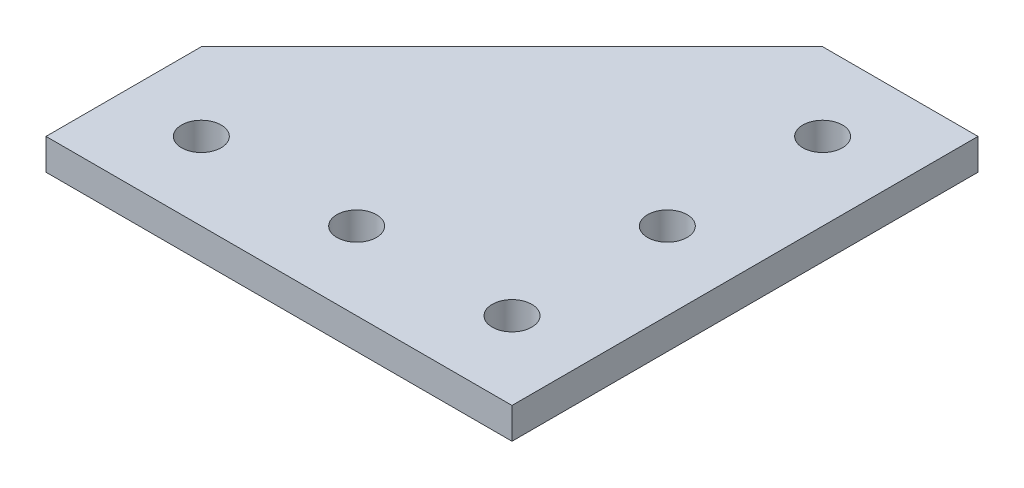
ISO-10303-21;
HEADER;
FILE_DESCRIPTION(('STEP AP214'),'2;1');
FILE_NAME('part.step','',(''),(''),'','','');
FILE_SCHEMA(('AUTOMOTIVE_DESIGN { 1 0 10303 214 1 1 1 1 }'));
ENDSEC;
DATA;
#1=APPLICATION_CONTEXT('core data for automotive mechanical design processes');
#2=APPLICATION_PROTOCOL_DEFINITION('international standard','automotive_design',2000,#1);
#3=PRODUCT_CONTEXT('',#1,'mechanical');
#4=PRODUCT('Part','Part','',(#3));
#5=PRODUCT_RELATED_PRODUCT_CATEGORY('part','',(#4));
#6=PRODUCT_DEFINITION_FORMATION('','',#4);
#7=PRODUCT_DEFINITION_CONTEXT('part definition',#1,'design');
#8=PRODUCT_DEFINITION('design','',#6,#7);
#9=PRODUCT_DEFINITION_SHAPE('','',#8);
#10=(LENGTH_UNIT() NAMED_UNIT(*) SI_UNIT(.MILLI.,.METRE.));
#11=(NAMED_UNIT(*) PLANE_ANGLE_UNIT() SI_UNIT($,.RADIAN.));
#12=(NAMED_UNIT(*) SI_UNIT($,.STERADIAN.) SOLID_ANGLE_UNIT());
#13=UNCERTAINTY_MEASURE_WITH_UNIT(LENGTH_MEASURE(1.E-05),#10,'distance_accuracy_value','');
#14=(GEOMETRIC_REPRESENTATION_CONTEXT(3) GLOBAL_UNCERTAINTY_ASSIGNED_CONTEXT((#13)) GLOBAL_UNIT_ASSIGNED_CONTEXT((#10,
#11,#12)) REPRESENTATION_CONTEXT('',''));
#15=CARTESIAN_POINT('',(0.,0.,0.));
#16=DIRECTION('',(0.,0.,1.));
#17=DIRECTION('',(1.,0.,0.));
#18=AXIS2_PLACEMENT_3D('',#15,#16,#17);
#19=CARTESIAN_POINT('',(0.,4.,0.));
#20=DIRECTION('',(0.,-1.,0.));
#21=DIRECTION('',(0.,0.,-1.));
#22=AXIS2_PLACEMENT_3D('',#19,#20,#21);
#23=PLANE('',#22);
#24=CARTESIAN_POINT('',(0.,4.,-20.));
#25=DIRECTION('',(0.,1.,0.));
#26=DIRECTION('',(0.,0.,1.));
#27=AXIS2_PLACEMENT_3D('',#24,#25,#26);
#28=CIRCLE('',#27,2.55);
#29=CARTESIAN_POINT('',(0.,4.,-17.45));
#30=VERTEX_POINT('',#29);
#31=EDGE_CURVE('E179',#30,#30,#28,.T.);
#32=ORIENTED_EDGE('',*,*,#31,.F.);
#33=EDGE_LOOP('',(#32));
#34=FACE_BOUND('',#33,.T.);
#35=CARTESIAN_POINT('',(-40.,4.,2.79318507107451E-13));
#36=DIRECTION('',(0.,1.,0.));
#37=DIRECTION('',(0.,0.,1.));
#38=AXIS2_PLACEMENT_3D('',#35,#36,#37);
#39=CIRCLE('',#38,2.55);
#40=CARTESIAN_POINT('',(-40.,4.,2.55000000000028));
#41=VERTEX_POINT('',#40);
#42=EDGE_CURVE('E191',#41,#41,#39,.T.);
#43=ORIENTED_EDGE('',*,*,#42,.F.);
#44=EDGE_LOOP('',(#43));
#45=FACE_BOUND('',#44,.T.);
#46=DIRECTION('',(-0.707106781186548,0.,0.707106781186547));
#47=VECTOR('',#46,1.);
#48=CARTESIAN_POINT('',(-50.,4.,-10.));
#49=LINE('',#48,#47);
#50=CARTESIAN_POINT('',(-10.,4.,-50.));
#51=VERTEX_POINT('',#50);
#52=CARTESIAN_POINT('',(-50.,4.,-10.));
#53=VERTEX_POINT('',#52);
#54=EDGE_CURVE('E119',#51,#53,#49,.T.);
#55=ORIENTED_EDGE('',*,*,#54,.T.);
#56=DIRECTION('',(0.,0.,1.));
#57=VECTOR('',#56,1.);
#58=CARTESIAN_POINT('',(-50.,4.,10.));
#59=LINE('',#58,#57);
#60=CARTESIAN_POINT('',(-50.,4.,10.));
#61=VERTEX_POINT('',#60);
#62=EDGE_CURVE('E86',#53,#61,#59,.T.);
#63=ORIENTED_EDGE('',*,*,#62,.T.);
#64=DIRECTION('',(1.,0.,0.));
#65=VECTOR('',#64,1.);
#66=CARTESIAN_POINT('',(10.,4.,9.99999999999999));
#67=LINE('',#66,#65);
#68=CARTESIAN_POINT('',(10.,4.,9.99999999999999));
#69=VERTEX_POINT('',#68);
#70=EDGE_CURVE('E90',#61,#69,#67,.T.);
#71=ORIENTED_EDGE('',*,*,#70,.T.);
#72=DIRECTION('',(0.,0.,-1.));
#73=VECTOR('',#72,1.);
#74=CARTESIAN_POINT('',(10.,4.,9.99999999999999));
#75=LINE('',#74,#73);
#76=CARTESIAN_POINT('',(10.,4.,-50.));
#77=VERTEX_POINT('',#76);
#78=EDGE_CURVE('E94',#69,#77,#75,.T.);
#79=ORIENTED_EDGE('',*,*,#78,.T.);
#80=DIRECTION('',(-1.,0.,0.));
#81=VECTOR('',#80,1.);
#82=CARTESIAN_POINT('',(-10.,4.,-50.));
#83=LINE('',#82,#81);
#84=EDGE_CURVE('E52',#77,#51,#83,.T.);
#85=ORIENTED_EDGE('',*,*,#84,.T.);
#86=EDGE_LOOP('',(#55,#63,#71,#79,#85));
#87=FACE_BOUND('',#86,.T.);
#88=CARTESIAN_POINT('',(-20.,4.,1.39659253553725E-13));
#89=DIRECTION('',(0.,1.,0.));
#90=DIRECTION('',(0.,0.,1.));
#91=AXIS2_PLACEMENT_3D('',#88,#89,#90);
#92=CIRCLE('',#91,2.55);
#93=CARTESIAN_POINT('',(-20.,4.,2.55000000000014));
#94=VERTEX_POINT('',#93);
#95=EDGE_CURVE('E114',#94,#94,#92,.T.);
#96=ORIENTED_EDGE('',*,*,#95,.F.);
#97=EDGE_LOOP('',(#96));
#98=FACE_BOUND('',#97,.T.);
#99=CARTESIAN_POINT('',(0.,4.,0.));
#100=DIRECTION('',(0.,1.,0.));
#101=DIRECTION('',(0.,0.,1.));
#102=AXIS2_PLACEMENT_3D('',#99,#100,#101);
#103=CIRCLE('',#102,2.55);
#104=CARTESIAN_POINT('',(0.,4.,2.55));
#105=VERTEX_POINT('',#104);
#106=EDGE_CURVE('E185',#105,#105,#103,.T.);
#107=ORIENTED_EDGE('',*,*,#106,.F.);
#108=EDGE_LOOP('',(#107));
#109=FACE_BOUND('',#108,.T.);
#110=CARTESIAN_POINT('',(-1.39693134871616E-13,4.,-40.));
#111=DIRECTION('',(0.,1.,0.));
#112=DIRECTION('',(0.,0.,1.));
#113=AXIS2_PLACEMENT_3D('',#110,#111,#112);
#114=CIRCLE('',#113,2.55);
#115=CARTESIAN_POINT('',(-1.39693134871616E-13,4.,-37.45));
#116=VERTEX_POINT('',#115);
#117=EDGE_CURVE('E170',#116,#116,#114,.T.);
#118=ORIENTED_EDGE('',*,*,#117,.F.);
#119=EDGE_LOOP('',(#118));
#120=FACE_BOUND('',#119,.T.);
#121=ADVANCED_FACE('F35',(#34,#45,#87,#98,#109,#120),#23,.F.);
#122=CARTESIAN_POINT('',(0.,0.,0.));
#123=DIRECTION('',(0.,-1.,0.));
#124=DIRECTION('',(0.,0.,-1.));
#125=AXIS2_PLACEMENT_3D('',#122,#123,#124);
#126=PLANE('',#125);
#127=CARTESIAN_POINT('',(0.,0.,-20.));
#128=DIRECTION('',(0.,1.,0.));
#129=DIRECTION('',(0.,0.,1.));
#130=AXIS2_PLACEMENT_3D('',#127,#128,#129);
#131=CIRCLE('',#130,2.55);
#132=CARTESIAN_POINT('',(0.,0.,-17.45));
#133=VERTEX_POINT('',#132);
#134=EDGE_CURVE('E176',#133,#133,#131,.T.);
#135=ORIENTED_EDGE('',*,*,#134,.T.);
#136=EDGE_LOOP('',(#135));
#137=FACE_BOUND('',#136,.T.);
#138=CARTESIAN_POINT('',(-40.,0.,2.79318507107451E-13));
#139=DIRECTION('',(0.,1.,0.));
#140=DIRECTION('',(0.,0.,1.));
#141=AXIS2_PLACEMENT_3D('',#138,#139,#140);
#142=CIRCLE('',#141,2.55);
#143=CARTESIAN_POINT('',(-40.,0.,2.55000000000028));
#144=VERTEX_POINT('',#143);
#145=EDGE_CURVE('E188',#144,#144,#142,.T.);
#146=ORIENTED_EDGE('',*,*,#145,.T.);
#147=EDGE_LOOP('',(#146));
#148=FACE_BOUND('',#147,.T.);
#149=DIRECTION('',(-0.707106781186548,0.,0.707106781186547));
#150=VECTOR('',#149,1.);
#151=CARTESIAN_POINT('',(-50.,0.,-10.));
#152=LINE('',#151,#150);
#153=CARTESIAN_POINT('',(-10.,0.,-50.));
#154=VERTEX_POINT('',#153);
#155=CARTESIAN_POINT('',(-50.,0.,-10.));
#156=VERTEX_POINT('',#155);
#157=EDGE_CURVE('E110',#154,#156,#152,.T.);
#158=ORIENTED_EDGE('',*,*,#157,.F.);
#159=DIRECTION('',(-1.,0.,0.));
#160=VECTOR('',#159,1.);
#161=CARTESIAN_POINT('',(-10.,0.,-50.));
#162=LINE('',#161,#160);
#163=CARTESIAN_POINT('',(10.,0.,-50.));
#164=VERTEX_POINT('',#163);
#165=EDGE_CURVE('E78',#164,#154,#162,.T.);
#166=ORIENTED_EDGE('',*,*,#165,.F.);
#167=DIRECTION('',(0.,0.,-1.));
#168=VECTOR('',#167,1.);
#169=CARTESIAN_POINT('',(10.,0.,9.99999999999999));
#170=LINE('',#169,#168);
#171=CARTESIAN_POINT('',(10.,0.,9.99999999999999));
#172=VERTEX_POINT('',#171);
#173=EDGE_CURVE('E72',#172,#164,#170,.T.);
#174=ORIENTED_EDGE('',*,*,#173,.F.);
#175=DIRECTION('',(1.,0.,0.));
#176=VECTOR('',#175,1.);
#177=CARTESIAN_POINT('',(10.,0.,9.99999999999999));
#178=LINE('',#177,#176);
#179=CARTESIAN_POINT('',(-50.,0.,10.));
#180=VERTEX_POINT('',#179);
#181=EDGE_CURVE('E101',#180,#172,#178,.T.);
#182=ORIENTED_EDGE('',*,*,#181,.F.);
#183=DIRECTION('',(0.,0.,1.));
#184=VECTOR('',#183,1.);
#185=CARTESIAN_POINT('',(-50.,0.,10.));
#186=LINE('',#185,#184);
#187=EDGE_CURVE('E113',#156,#180,#186,.T.);
#188=ORIENTED_EDGE('',*,*,#187,.F.);
#189=EDGE_LOOP('',(#158,#166,#174,#182,#188));
#190=FACE_BOUND('',#189,.T.);
#191=CARTESIAN_POINT('',(-20.,0.,1.39659253553725E-13));
#192=DIRECTION('',(0.,1.,0.));
#193=DIRECTION('',(0.,0.,1.));
#194=AXIS2_PLACEMENT_3D('',#191,#192,#193);
#195=CIRCLE('',#194,2.55);
#196=CARTESIAN_POINT('',(-20.,0.,2.55000000000014));
#197=VERTEX_POINT('',#196);
#198=EDGE_CURVE('E194',#197,#197,#195,.T.);
#199=ORIENTED_EDGE('',*,*,#198,.T.);
#200=EDGE_LOOP('',(#199));
#201=FACE_BOUND('',#200,.T.);
#202=CARTESIAN_POINT('',(0.,0.,0.));
#203=DIRECTION('',(0.,1.,0.));
#204=DIRECTION('',(0.,0.,1.));
#205=AXIS2_PLACEMENT_3D('',#202,#203,#204);
#206=CIRCLE('',#205,2.55);
#207=CARTESIAN_POINT('',(0.,0.,2.55));
#208=VERTEX_POINT('',#207);
#209=EDGE_CURVE('E182',#208,#208,#206,.T.);
#210=ORIENTED_EDGE('',*,*,#209,.T.);
#211=EDGE_LOOP('',(#210));
#212=FACE_BOUND('',#211,.T.);
#213=CARTESIAN_POINT('',(-1.39693134871616E-13,0.,-40.));
#214=DIRECTION('',(0.,1.,0.));
#215=DIRECTION('',(0.,0.,1.));
#216=AXIS2_PLACEMENT_3D('',#213,#214,#215);
#217=CIRCLE('',#216,2.55);
#218=CARTESIAN_POINT('',(-1.39693134871616E-13,0.,-37.45));
#219=VERTEX_POINT('',#218);
#220=EDGE_CURVE('E173',#219,#219,#217,.T.);
#221=ORIENTED_EDGE('',*,*,#220,.T.);
#222=EDGE_LOOP('',(#221));
#223=FACE_BOUND('',#222,.T.);
#224=ADVANCED_FACE('F123',(#137,#148,#190,#201,#212,#223),#126,.T.);
#225=CARTESIAN_POINT('',(-50.,4.,-10.));
#226=DIRECTION('',(0.707106781186547,0.,0.707106781186548));
#227=DIRECTION('',(0.707106781186548,0.,-0.707106781186547));
#228=AXIS2_PLACEMENT_3D('',#225,#226,#227);
#229=PLANE('',#228);
#230=ORIENTED_EDGE('',*,*,#157,.T.);
#231=DIRECTION('',(0.,-1.,0.));
#232=VECTOR('',#231,1.);
#233=CARTESIAN_POINT('',(-50.,4.,-10.));
#234=LINE('',#233,#232);
#235=EDGE_CURVE('E11',#53,#156,#234,.T.);
#236=ORIENTED_EDGE('',*,*,#235,.F.);
#237=ORIENTED_EDGE('',*,*,#54,.F.);
#238=DIRECTION('',(0.,-1.,0.));
#239=VECTOR('',#238,1.);
#240=CARTESIAN_POINT('',(-10.,4.,-50.));
#241=LINE('',#240,#239);
#242=EDGE_CURVE('E106',#51,#154,#241,.T.);
#243=ORIENTED_EDGE('',*,*,#242,.T.);
#244=EDGE_LOOP('',(#230,#236,#237,#243));
#245=FACE_BOUND('',#244,.T.);
#246=ADVANCED_FACE('F37',(#245),#229,.F.);
#247=CARTESIAN_POINT('',(-50.,4.,10.));
#248=DIRECTION('',(1.,0.,0.));
#249=DIRECTION('',(0.,0.,-1.));
#250=AXIS2_PLACEMENT_3D('',#247,#248,#249);
#251=PLANE('',#250);
#252=ORIENTED_EDGE('',*,*,#187,.T.);
#253=DIRECTION('',(0.,-1.,0.));
#254=VECTOR('',#253,1.);
#255=CARTESIAN_POINT('',(-50.,4.,10.));
#256=LINE('',#255,#254);
#257=EDGE_CURVE('E44',#61,#180,#256,.T.);
#258=ORIENTED_EDGE('',*,*,#257,.F.);
#259=ORIENTED_EDGE('',*,*,#62,.F.);
#260=ORIENTED_EDGE('',*,*,#235,.T.);
#261=EDGE_LOOP('',(#252,#258,#259,#260));
#262=FACE_BOUND('',#261,.T.);
#263=ADVANCED_FACE('F251',(#262),#251,.F.);
#264=CARTESIAN_POINT('',(10.,4.,9.99999999999999));
#265=DIRECTION('',(0.,0.,-1.));
#266=DIRECTION('',(-1.,0.,0.));
#267=AXIS2_PLACEMENT_3D('',#264,#265,#266);
#268=PLANE('',#267);
#269=ORIENTED_EDGE('',*,*,#181,.T.);
#270=DIRECTION('',(0.,-1.,0.));
#271=VECTOR('',#270,1.);
#272=CARTESIAN_POINT('',(10.,4.,9.99999999999999));
#273=LINE('',#272,#271);
#274=EDGE_CURVE('E98',#69,#172,#273,.T.);
#275=ORIENTED_EDGE('',*,*,#274,.F.);
#276=ORIENTED_EDGE('',*,*,#70,.F.);
#277=ORIENTED_EDGE('',*,*,#257,.T.);
#278=EDGE_LOOP('',(#269,#275,#276,#277));
#279=FACE_BOUND('',#278,.T.);
#280=ADVANCED_FACE('F99',(#279),#268,.F.);
#281=CARTESIAN_POINT('',(10.,4.,9.99999999999999));
#282=DIRECTION('',(-1.,0.,0.));
#283=DIRECTION('',(0.,0.,1.));
#284=AXIS2_PLACEMENT_3D('',#281,#282,#283);
#285=PLANE('',#284);
#286=ORIENTED_EDGE('',*,*,#173,.T.);
#287=DIRECTION('',(0.,-1.,0.));
#288=VECTOR('',#287,1.);
#289=CARTESIAN_POINT('',(10.,4.,-50.));
#290=LINE('',#289,#288);
#291=EDGE_CURVE('E102',#77,#164,#290,.T.);
#292=ORIENTED_EDGE('',*,*,#291,.F.);
#293=ORIENTED_EDGE('',*,*,#78,.F.);
#294=ORIENTED_EDGE('',*,*,#274,.T.);
#295=EDGE_LOOP('',(#286,#292,#293,#294));
#296=FACE_BOUND('',#295,.T.);
#297=ADVANCED_FACE('F104',(#296),#285,.F.);
#298=CARTESIAN_POINT('',(-10.,4.,-50.));
#299=DIRECTION('',(0.,0.,1.));
#300=DIRECTION('',(1.,0.,0.));
#301=AXIS2_PLACEMENT_3D('',#298,#299,#300);
#302=PLANE('',#301);
#303=ORIENTED_EDGE('',*,*,#165,.T.);
#304=ORIENTED_EDGE('',*,*,#242,.F.);
#305=ORIENTED_EDGE('',*,*,#84,.F.);
#306=ORIENTED_EDGE('',*,*,#291,.T.);
#307=EDGE_LOOP('',(#303,#304,#305,#306));
#308=FACE_BOUND('',#307,.T.);
#309=ADVANCED_FACE('F128',(#308),#302,.F.);
#310=CARTESIAN_POINT('',(-20.,4.,1.39659253553725E-13));
#311=DIRECTION('',(0.,-1.,0.));
#312=DIRECTION('',(0.,0.,-1.));
#313=AXIS2_PLACEMENT_3D('',#310,#311,#312);
#314=CYLINDRICAL_SURFACE('',#313,2.55);
#315=ORIENTED_EDGE('',*,*,#95,.T.);
#316=EDGE_LOOP('',(#315));
#317=FACE_BOUND('',#316,.T.);
#318=ORIENTED_EDGE('',*,*,#198,.F.);
#319=EDGE_LOOP('',(#318));
#320=FACE_BOUND('',#319,.T.);
#321=ADVANCED_FACE('F130',(#317,#320),#314,.F.);
#322=CARTESIAN_POINT('',(-40.,4.,2.79318507107451E-13));
#323=DIRECTION('',(0.,-1.,0.));
#324=DIRECTION('',(0.,0.,-1.));
#325=AXIS2_PLACEMENT_3D('',#322,#323,#324);
#326=CYLINDRICAL_SURFACE('',#325,2.55);
#327=ORIENTED_EDGE('',*,*,#42,.T.);
#328=EDGE_LOOP('',(#327));
#329=FACE_BOUND('',#328,.T.);
#330=ORIENTED_EDGE('',*,*,#145,.F.);
#331=EDGE_LOOP('',(#330));
#332=FACE_BOUND('',#331,.T.);
#333=ADVANCED_FACE('F136',(#329,#332),#326,.F.);
#334=CARTESIAN_POINT('',(0.,4.,0.));
#335=DIRECTION('',(0.,-1.,0.));
#336=DIRECTION('',(0.,0.,-1.));
#337=AXIS2_PLACEMENT_3D('',#334,#335,#336);
#338=CYLINDRICAL_SURFACE('',#337,2.55);
#339=ORIENTED_EDGE('',*,*,#106,.T.);
#340=EDGE_LOOP('',(#339));
#341=FACE_BOUND('',#340,.T.);
#342=ORIENTED_EDGE('',*,*,#209,.F.);
#343=EDGE_LOOP('',(#342));
#344=FACE_BOUND('',#343,.T.);
#345=ADVANCED_FACE('F153',(#341,#344),#338,.F.);
#346=CARTESIAN_POINT('',(0.,4.,-20.));
#347=DIRECTION('',(0.,-1.,0.));
#348=DIRECTION('',(0.,0.,-1.));
#349=AXIS2_PLACEMENT_3D('',#346,#347,#348);
#350=CYLINDRICAL_SURFACE('',#349,2.55);
#351=ORIENTED_EDGE('',*,*,#31,.T.);
#352=EDGE_LOOP('',(#351));
#353=FACE_BOUND('',#352,.T.);
#354=ORIENTED_EDGE('',*,*,#134,.F.);
#355=EDGE_LOOP('',(#354));
#356=FACE_BOUND('',#355,.T.);
#357=ADVANCED_FACE('F157',(#353,#356),#350,.F.);
#358=CARTESIAN_POINT('',(-1.39693134871616E-13,4.,-40.));
#359=DIRECTION('',(0.,-1.,0.));
#360=DIRECTION('',(0.,0.,-1.));
#361=AXIS2_PLACEMENT_3D('',#358,#359,#360);
#362=CYLINDRICAL_SURFACE('',#361,2.55);
#363=ORIENTED_EDGE('',*,*,#117,.T.);
#364=EDGE_LOOP('',(#363));
#365=FACE_BOUND('',#364,.T.);
#366=ORIENTED_EDGE('',*,*,#220,.F.);
#367=EDGE_LOOP('',(#366));
#368=FACE_BOUND('',#367,.T.);
#369=ADVANCED_FACE('F161',(#365,#368),#362,.F.);
#370=CLOSED_SHELL('',(#121,#224,#246,#263,#280,#297,#309,#321,#333,#345,#357,#369));
#371=MANIFOLD_SOLID_BREP('B2',#370);
#372=ADVANCED_BREP_SHAPE_REPRESENTATION('',(#18,#371),#14);
#373=SHAPE_DEFINITION_REPRESENTATION(#9,#372);
ENDSEC;
END-ISO-10303-21;
